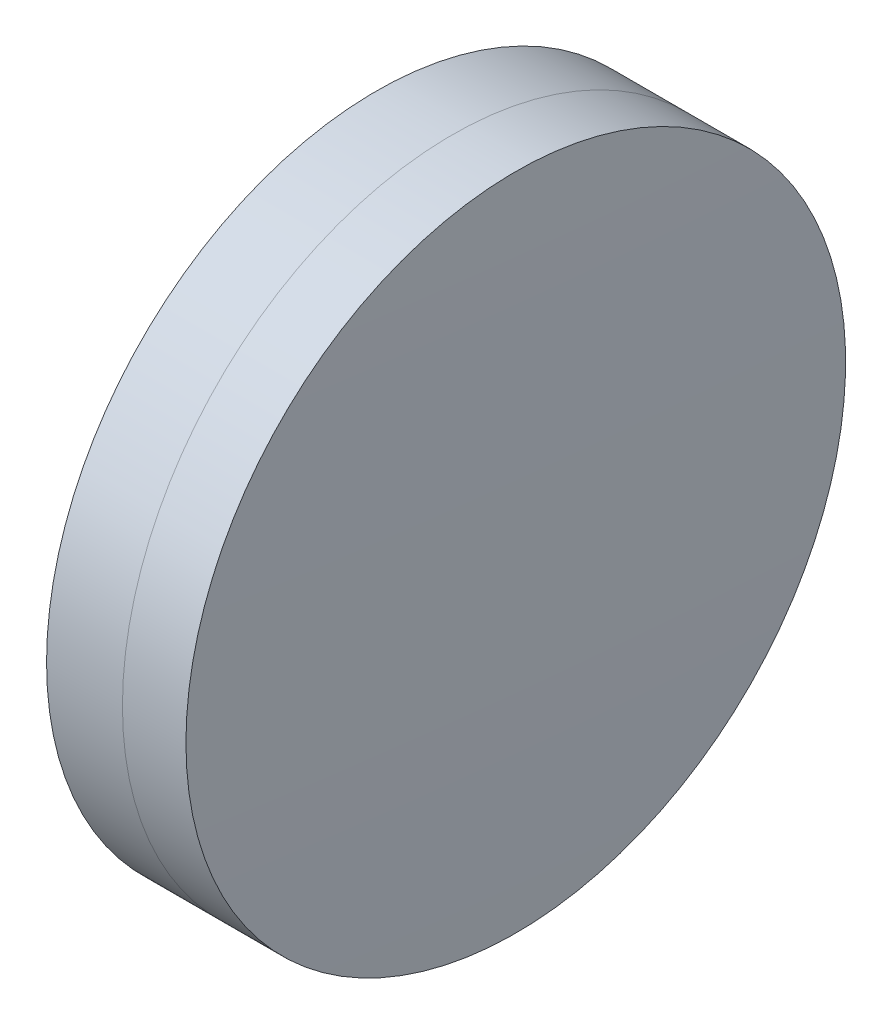
ISO-10303-21;
HEADER;
FILE_DESCRIPTION(('STEP AP214'),'2;1');
FILE_NAME('part.step','',(''),(''),'','','');
FILE_SCHEMA(('AUTOMOTIVE_DESIGN { 1 0 10303 214 1 1 1 1 }'));
ENDSEC;
DATA;
#1=APPLICATION_CONTEXT('core data for automotive mechanical design processes');
#2=APPLICATION_PROTOCOL_DEFINITION('international standard','automotive_design',2000,#1);
#3=PRODUCT_CONTEXT('',#1,'mechanical');
#4=PRODUCT('Part','Part','',(#3));
#5=PRODUCT_RELATED_PRODUCT_CATEGORY('part','',(#4));
#6=PRODUCT_DEFINITION_FORMATION('','',#4);
#7=PRODUCT_DEFINITION_CONTEXT('part definition',#1,'design');
#8=PRODUCT_DEFINITION('design','',#6,#7);
#9=PRODUCT_DEFINITION_SHAPE('','',#8);
#10=(LENGTH_UNIT() NAMED_UNIT(*) SI_UNIT(.MILLI.,.METRE.));
#11=(NAMED_UNIT(*) PLANE_ANGLE_UNIT() SI_UNIT($,.RADIAN.));
#12=(NAMED_UNIT(*) SI_UNIT($,.STERADIAN.) SOLID_ANGLE_UNIT());
#13=UNCERTAINTY_MEASURE_WITH_UNIT(LENGTH_MEASURE(1.E-05),#10,'distance_accuracy_value','');
#14=(GEOMETRIC_REPRESENTATION_CONTEXT(3) GLOBAL_UNCERTAINTY_ASSIGNED_CONTEXT((#13)) GLOBAL_UNIT_ASSIGNED_CONTEXT((#10,
#11,#12)) REPRESENTATION_CONTEXT('',''));
#15=CARTESIAN_POINT('',(0.,0.,0.));
#16=DIRECTION('',(0.,0.,1.));
#17=DIRECTION('',(1.,0.,0.));
#18=AXIS2_PLACEMENT_3D('',#15,#16,#17);
#19=CARTESIAN_POINT('',(180.899447543102,0.,0.));
#20=DIRECTION('',(-1.,0.,0.));
#21=DIRECTION('',(0.,0.,1.));
#22=AXIS2_PLACEMENT_3D('',#19,#20,#21);
#23=SPHERICAL_SURFACE('',#22,137.1);
#24=CARTESIAN_POINT('',(317.409959958813,0.,0.));
#25=DIRECTION('',(-1.,0.,0.));
#26=DIRECTION('',(0.,0.,1.));
#27=AXIS2_PLACEMENT_3D('',#24,#25,#26);
#28=CIRCLE('',#27,12.7);
#29=CARTESIAN_POINT('',(317.409959958813,0.,12.7));
#30=VERTEX_POINT('',#29);
#31=EDGE_CURVE('E11',#30,#30,#28,.T.);
#32=ORIENTED_EDGE('',*,*,#31,.T.);
#33=EDGE_LOOP('',(#32));
#34=FACE_BOUND('',#33,.T.);
#35=ADVANCED_FACE('F45',(#34),#23,.F.);
#36=CARTESIAN_POINT('',(-0.551919992657797,0.,0.));
#37=DIRECTION('',(-1.,0.,0.));
#38=DIRECTION('',(0.,0.,1.));
#39=AXIS2_PLACEMENT_3D('',#36,#37,#38);
#40=CYLINDRICAL_SURFACE('',#39,12.7);
#41=CARTESIAN_POINT('',(319.854748101114,0.,0.));
#42=DIRECTION('',(-1.,0.,0.));
#43=DIRECTION('',(0.,0.,1.));
#44=AXIS2_PLACEMENT_3D('',#41,#42,#43);
#45=CIRCLE('',#44,12.7);
#46=CARTESIAN_POINT('',(319.854748101114,0.,12.7));
#47=VERTEX_POINT('',#46);
#48=EDGE_CURVE('E51',#47,#47,#45,.T.);
#49=ORIENTED_EDGE('',*,*,#48,.T.);
#50=EDGE_LOOP('',(#49));
#51=FACE_BOUND('',#50,.T.);
#52=ORIENTED_EDGE('',*,*,#31,.F.);
#53=EDGE_LOOP('',(#52));
#54=FACE_BOUND('',#53,.T.);
#55=ADVANCED_FACE('F57',(#51,#54),#40,.T.);
#56=CARTESIAN_POINT('',(-237.400552456898,0.,0.));
#57=DIRECTION('',(-1.,0.,0.));
#58=DIRECTION('',(0.,0.,1.));
#59=AXIS2_PLACEMENT_3D('',#56,#57,#58);
#60=SPHERICAL_SURFACE('',#59,557.4);
#61=ORIENTED_EDGE('',*,*,#48,.F.);
#62=EDGE_LOOP('',(#61));
#63=FACE_BOUND('',#62,.T.);
#64=ADVANCED_FACE('F60',(#63),#60,.T.);
#65=CLOSED_SHELL('',(#35,#55,#64));
#66=MANIFOLD_SOLID_BREP('B2',#65);
#67=CARTESIAN_POINT('',(479.199447543102,0.,0.));
#68=DIRECTION('',(-1.,0.,0.));
#69=DIRECTION('',(0.,0.,1.));
#70=AXIS2_PLACEMENT_3D('',#67,#68,#69);
#71=SPHERICAL_SURFACE('',#70,165.2);
#72=CARTESIAN_POINT('',(314.488336806759,0.,0.));
#73=DIRECTION('',(-1.,0.,0.));
#74=DIRECTION('',(0.,0.,1.));
#75=AXIS2_PLACEMENT_3D('',#72,#73,#74);
#76=CIRCLE('',#75,12.7);
#77=CARTESIAN_POINT('',(314.488336806759,0.,12.7));
#78=VERTEX_POINT('',#77);
#79=EDGE_CURVE('E44',#78,#78,#76,.T.);
#80=ORIENTED_EDGE('',*,*,#79,.T.);
#81=EDGE_LOOP('',(#80));
#82=FACE_BOUND('',#81,.T.);
#83=ADVANCED_FACE('F86',(#82),#71,.T.);
#84=CARTESIAN_POINT('',(235.807450690754,0.,0.));
#85=DIRECTION('',(-1.,0.,0.));
#86=DIRECTION('',(0.,0.,1.));
#87=AXIS2_PLACEMENT_3D('',#84,#85,#86);
#88=CYLINDRICAL_SURFACE('',#87,12.7);
#89=CARTESIAN_POINT('',(317.409959958813,0.,0.));
#90=DIRECTION('',(-1.,0.,0.));
#91=DIRECTION('',(0.,0.,1.));
#92=AXIS2_PLACEMENT_3D('',#89,#90,#91);
#93=CIRCLE('',#92,12.7);
#94=CARTESIAN_POINT('',(317.409959958813,0.,12.7));
#95=VERTEX_POINT('',#94);
#96=EDGE_CURVE('E92',#95,#95,#93,.T.);
#97=ORIENTED_EDGE('',*,*,#96,.T.);
#98=EDGE_LOOP('',(#97));
#99=FACE_BOUND('',#98,.T.);
#100=ORIENTED_EDGE('',*,*,#79,.F.);
#101=EDGE_LOOP('',(#100));
#102=FACE_BOUND('',#101,.T.);
#103=ADVANCED_FACE('F98',(#99,#102),#88,.T.);
#104=CARTESIAN_POINT('',(180.899447543102,0.,0.));
#105=DIRECTION('',(-1.,0.,0.));
#106=DIRECTION('',(0.,0.,1.));
#107=AXIS2_PLACEMENT_3D('',#104,#105,#106);
#108=SPHERICAL_SURFACE('',#107,137.1);
#109=ORIENTED_EDGE('',*,*,#96,.F.);
#110=EDGE_LOOP('',(#109));
#111=FACE_BOUND('',#110,.T.);
#112=ADVANCED_FACE('F101',(#111),#108,.T.);
#113=CLOSED_SHELL('',(#83,#103,#112));
#114=MANIFOLD_SOLID_BREP('B6',#113);
#115=ADVANCED_BREP_SHAPE_REPRESENTATION('',(#18,#66,#114),#14);
#116=SHAPE_DEFINITION_REPRESENTATION(#9,#115);
ENDSEC;
END-ISO-10303-21;
